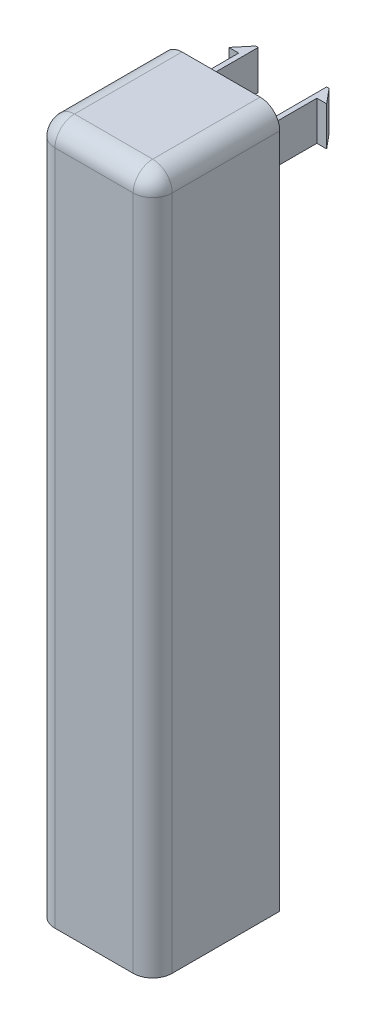
ISO-10303-21;
HEADER;
FILE_DESCRIPTION(('STEP AP214'),'2;1');
FILE_NAME('part.step','',(''),(''),'','','');
FILE_SCHEMA(('AUTOMOTIVE_DESIGN { 1 0 10303 214 1 1 1 1 }'));
ENDSEC;
DATA;
#1=APPLICATION_CONTEXT('core data for automotive mechanical design processes');
#2=APPLICATION_PROTOCOL_DEFINITION('international standard','automotive_design',2000,#1);
#3=PRODUCT_CONTEXT('',#1,'mechanical');
#4=PRODUCT('Part','Part','',(#3));
#5=PRODUCT_RELATED_PRODUCT_CATEGORY('part','',(#4));
#6=PRODUCT_DEFINITION_FORMATION('','',#4);
#7=PRODUCT_DEFINITION_CONTEXT('part definition',#1,'design');
#8=PRODUCT_DEFINITION('design','',#6,#7);
#9=PRODUCT_DEFINITION_SHAPE('','',#8);
#10=(LENGTH_UNIT() NAMED_UNIT(*) SI_UNIT(.MILLI.,.METRE.));
#11=(NAMED_UNIT(*) PLANE_ANGLE_UNIT() SI_UNIT($,.RADIAN.));
#12=(NAMED_UNIT(*) SI_UNIT($,.STERADIAN.) SOLID_ANGLE_UNIT());
#13=UNCERTAINTY_MEASURE_WITH_UNIT(LENGTH_MEASURE(1.E-05),#10,'distance_accuracy_value','');
#14=(GEOMETRIC_REPRESENTATION_CONTEXT(3) GLOBAL_UNCERTAINTY_ASSIGNED_CONTEXT((#13)) GLOBAL_UNIT_ASSIGNED_CONTEXT((#10,
#11,#12)) REPRESENTATION_CONTEXT('',''));
#15=CARTESIAN_POINT('',(0.,0.,0.));
#16=DIRECTION('',(0.,0.,1.));
#17=DIRECTION('',(1.,0.,0.));
#18=AXIS2_PLACEMENT_3D('',#15,#16,#17);
#19=CARTESIAN_POINT('',(0.,0.,0.));
#20=DIRECTION('',(0.,0.,1.));
#21=DIRECTION('',(1.,0.,0.));
#22=AXIS2_PLACEMENT_3D('',#19,#20,#21);
#23=PLANE('',#22);
#24=DIRECTION('',(0.,-1.,0.));
#25=VECTOR('',#24,1.);
#26=CARTESIAN_POINT('',(34.8,24.3,0.));
#27=LINE('',#26,#25);
#28=CARTESIAN_POINT('',(34.8,24.3,0.));
#29=VERTEX_POINT('',#28);
#30=CARTESIAN_POINT('',(34.8,20.3,0.));
#31=VERTEX_POINT('',#30);
#32=EDGE_CURVE('E277',#29,#31,#27,.T.);
#33=ORIENTED_EDGE('',*,*,#32,.F.);
#34=DIRECTION('',(0.,-1.,0.));
#35=VECTOR('',#34,1.);
#36=CARTESIAN_POINT('',(34.8,0.,0.));
#37=LINE('',#36,#35);
#38=CARTESIAN_POINT('',(34.8,25.3,0.));
#39=VERTEX_POINT('',#38);
#40=EDGE_CURVE('E346',#39,#29,#37,.T.);
#41=ORIENTED_EDGE('',*,*,#40,.F.);
#42=DIRECTION('',(-1.,0.,0.));
#43=VECTOR('',#42,1.);
#44=CARTESIAN_POINT('',(24.8,25.3,0.));
#45=LINE('',#44,#43);
#46=CARTESIAN_POINT('',(26.8,25.3,0.));
#47=VERTEX_POINT('',#46);
#48=EDGE_CURVE('E332',#39,#47,#45,.T.);
#49=ORIENTED_EDGE('',*,*,#48,.T.);
#50=DIRECTION('',(0.,-1.,0.));
#51=VECTOR('',#50,1.);
#52=CARTESIAN_POINT('',(26.8,0.,0.));
#53=LINE('',#52,#51);
#54=CARTESIAN_POINT('',(26.8,24.3,0.));
#55=VERTEX_POINT('',#54);
#56=EDGE_CURVE('E369',#47,#55,#53,.T.);
#57=ORIENTED_EDGE('',*,*,#56,.T.);
#58=DIRECTION('',(0.,1.,0.));
#59=VECTOR('',#58,1.);
#60=CARTESIAN_POINT('',(26.8,24.3,0.));
#61=LINE('',#60,#59);
#62=CARTESIAN_POINT('',(26.7999999999995,20.3000000000004,0.));
#63=VERTEX_POINT('',#62);
#64=EDGE_CURVE('E297',#63,#55,#61,.T.);
#65=ORIENTED_EDGE('',*,*,#64,.F.);
#66=CARTESIAN_POINT('',(26.8,-43.85,0.));
#67=VERTEX_POINT('',#66);
#68=EDGE_CURVE('E363',#63,#67,#53,.T.);
#69=ORIENTED_EDGE('',*,*,#68,.T.);
#70=DIRECTION('',(1.,0.,0.));
#71=VECTOR('',#70,1.);
#72=CARTESIAN_POINT('',(0.,-43.85,0.));
#73=LINE('',#72,#71);
#74=CARTESIAN_POINT('',(24.8,-43.85,0.));
#75=VERTEX_POINT('',#74);
#76=EDGE_CURVE('E368',#75,#67,#73,.T.);
#77=ORIENTED_EDGE('',*,*,#76,.F.);
#78=DIRECTION('',(0.,1.,0.));
#79=VECTOR('',#78,1.);
#80=CARTESIAN_POINT('',(24.8,0.,0.));
#81=LINE('',#80,#79);
#82=CARTESIAN_POINT('',(24.8,25.3,0.));
#83=VERTEX_POINT('',#82);
#84=EDGE_CURVE('E371',#75,#83,#81,.T.);
#85=ORIENTED_EDGE('',*,*,#84,.T.);
#86=CARTESIAN_POINT('',(26.8,25.3,0.));
#87=DIRECTION('',(0.,0.,1.));
#88=DIRECTION('',(1.,0.,0.));
#89=AXIS2_PLACEMENT_3D('',#86,#87,#88);
#90=CIRCLE('',#89,2.);
#91=CARTESIAN_POINT('',(26.8,27.3,0.));
#92=VERTEX_POINT('',#91);
#93=EDGE_CURVE('E400',#83,#92,#90,.F.);
#94=ORIENTED_EDGE('',*,*,#93,.T.);
#95=DIRECTION('',(1.,0.,0.));
#96=VECTOR('',#95,1.);
#97=CARTESIAN_POINT('',(0.,27.3,0.));
#98=LINE('',#97,#96);
#99=CARTESIAN_POINT('',(34.8,27.3,0.));
#100=VERTEX_POINT('',#99);
#101=EDGE_CURVE('E380',#92,#100,#98,.T.);
#102=ORIENTED_EDGE('',*,*,#101,.T.);
#103=CARTESIAN_POINT('',(34.8,25.3,0.));
#104=DIRECTION('',(0.,0.,1.));
#105=DIRECTION('',(1.,0.,0.));
#106=AXIS2_PLACEMENT_3D('',#103,#104,#105);
#107=CIRCLE('',#106,2.);
#108=CARTESIAN_POINT('',(36.8,25.3,0.));
#109=VERTEX_POINT('',#108);
#110=EDGE_CURVE('E402',#100,#109,#107,.F.);
#111=ORIENTED_EDGE('',*,*,#110,.T.);
#112=DIRECTION('',(0.,-1.,0.));
#113=VECTOR('',#112,1.);
#114=CARTESIAN_POINT('',(36.8,0.,0.));
#115=LINE('',#114,#113);
#116=CARTESIAN_POINT('',(36.8,-43.85,0.));
#117=VERTEX_POINT('',#116);
#118=EDGE_CURVE('E345',#109,#117,#115,.T.);
#119=ORIENTED_EDGE('',*,*,#118,.T.);
#120=DIRECTION('',(1.,0.,0.));
#121=VECTOR('',#120,1.);
#122=CARTESIAN_POINT('',(0.,-43.85,0.));
#123=LINE('',#122,#121);
#124=CARTESIAN_POINT('',(34.8,-43.85,0.));
#125=VERTEX_POINT('',#124);
#126=EDGE_CURVE('E348',#125,#117,#123,.T.);
#127=ORIENTED_EDGE('',*,*,#126,.F.);
#128=EDGE_CURVE('E341',#31,#125,#37,.T.);
#129=ORIENTED_EDGE('',*,*,#128,.F.);
#130=EDGE_LOOP('',(#33,#41,#49,#57,#65,#69,#77,#85,#94,#102,#111,#119,#127,#129));
#131=FACE_BOUND('',#130,.T.);
#132=ADVANCED_FACE('F39',(#131),#23,.F.);
#133=CARTESIAN_POINT('',(0.,0.,11.));
#134=DIRECTION('',(0.,0.,1.));
#135=DIRECTION('',(1.,0.,0.));
#136=AXIS2_PLACEMENT_3D('',#133,#134,#135);
#137=PLANE('',#136);
#138=DIRECTION('',(0.,-1.,0.));
#139=VECTOR('',#138,1.);
#140=CARTESIAN_POINT('',(26.8,0.,11.));
#141=LINE('',#140,#139);
#142=CARTESIAN_POINT('',(26.8,25.3,11.));
#143=VERTEX_POINT('',#142);
#144=CARTESIAN_POINT('',(26.8,-43.85,11.));
#145=VERTEX_POINT('',#144);
#146=EDGE_CURVE('E364',#143,#145,#141,.T.);
#147=ORIENTED_EDGE('',*,*,#146,.F.);
#148=DIRECTION('',(-1.,0.,0.));
#149=VECTOR('',#148,1.);
#150=CARTESIAN_POINT('',(26.8,25.3,11.));
#151=LINE('',#150,#149);
#152=CARTESIAN_POINT('',(34.8,25.3,11.));
#153=VERTEX_POINT('',#152);
#154=EDGE_CURVE('E329',#153,#143,#151,.T.);
#155=ORIENTED_EDGE('',*,*,#154,.F.);
#156=DIRECTION('',(0.,-1.,0.));
#157=VECTOR('',#156,1.);
#158=CARTESIAN_POINT('',(34.8,0.,11.));
#159=LINE('',#158,#157);
#160=CARTESIAN_POINT('',(34.8,-43.85,11.));
#161=VERTEX_POINT('',#160);
#162=EDGE_CURVE('E342',#153,#161,#159,.T.);
#163=ORIENTED_EDGE('',*,*,#162,.T.);
#164=DIRECTION('',(1.,0.,0.));
#165=VECTOR('',#164,1.);
#166=CARTESIAN_POINT('',(24.8,-43.85,11.));
#167=LINE('',#166,#165);
#168=EDGE_CURVE('E354',#145,#161,#167,.T.);
#169=ORIENTED_EDGE('',*,*,#168,.F.);
#170=EDGE_LOOP('',(#147,#155,#163,#169));
#171=FACE_BOUND('',#170,.T.);
#172=ADVANCED_FACE('F502',(#171),#137,.F.);
#173=CARTESIAN_POINT('',(34.8,0.,11.));
#174=DIRECTION('',(1.,0.,0.));
#175=DIRECTION('',(0.,0.,-1.));
#176=AXIS2_PLACEMENT_3D('',#173,#174,#175);
#177=PLANE('',#176);
#178=DIRECTION('',(0.,-1.,0.));
#179=VECTOR('',#178,1.);
#180=CARTESIAN_POINT('',(34.8,26.4213203435602,1.00000000000045));
#181=LINE('',#180,#179);
#182=CARTESIAN_POINT('',(34.8,24.3,1.00000000000045));
#183=VERTEX_POINT('',#182);
#184=CARTESIAN_POINT('',(34.8,20.3000000000005,1.00000000000042));
#185=VERTEX_POINT('',#184);
#186=EDGE_CURVE('E56',#183,#185,#181,.T.);
#187=ORIENTED_EDGE('',*,*,#186,.T.);
#188=DIRECTION('',(0.,0.,1.));
#189=VECTOR('',#188,1.);
#190=CARTESIAN_POINT('',(34.8,20.3000000000005,1.00000000000045));
#191=LINE('',#190,#189);
#192=EDGE_CURVE('E287',#31,#185,#191,.T.);
#193=ORIENTED_EDGE('',*,*,#192,.F.);
#194=ORIENTED_EDGE('',*,*,#128,.T.);
#195=DIRECTION('',(0.,0.,-1.));
#196=VECTOR('',#195,1.);
#197=CARTESIAN_POINT('',(34.8,-43.85,11.));
#198=LINE('',#197,#196);
#199=EDGE_CURVE('E344',#161,#125,#198,.T.);
#200=ORIENTED_EDGE('',*,*,#199,.F.);
#201=ORIENTED_EDGE('',*,*,#162,.F.);
#202=DIRECTION('',(0.,0.,1.));
#203=VECTOR('',#202,1.);
#204=CARTESIAN_POINT('',(34.8,25.3,11.));
#205=LINE('',#204,#203);
#206=EDGE_CURVE('E335',#39,#153,#205,.T.);
#207=ORIENTED_EDGE('',*,*,#206,.F.);
#208=ORIENTED_EDGE('',*,*,#40,.T.);
#209=DIRECTION('',(0.,0.,-1.));
#210=VECTOR('',#209,1.);
#211=CARTESIAN_POINT('',(34.8,24.3,1.00000000000045));
#212=LINE('',#211,#210);
#213=EDGE_CURVE('E61',#183,#29,#212,.T.);
#214=ORIENTED_EDGE('',*,*,#213,.F.);
#215=EDGE_LOOP('',(#187,#193,#194,#200,#201,#207,#208,#214));
#216=FACE_BOUND('',#215,.T.);
#217=ADVANCED_FACE('F479',(#216),#177,.F.);
#218=CARTESIAN_POINT('',(0.,0.,13.));
#219=DIRECTION('',(0.,0.,1.));
#220=DIRECTION('',(1.,0.,0.));
#221=AXIS2_PLACEMENT_3D('',#218,#219,#220);
#222=PLANE('',#221);
#223=DIRECTION('',(1.,0.,0.));
#224=VECTOR('',#223,1.);
#225=CARTESIAN_POINT('',(24.8,-43.85,13.));
#226=LINE('',#225,#224);
#227=CARTESIAN_POINT('',(26.8,-43.85,13.));
#228=VERTEX_POINT('',#227);
#229=CARTESIAN_POINT('',(34.8,-43.85,13.));
#230=VERTEX_POINT('',#229);
#231=EDGE_CURVE('E355',#228,#230,#226,.T.);
#232=ORIENTED_EDGE('',*,*,#231,.T.);
#233=DIRECTION('',(0.,1.,0.));
#234=VECTOR('',#233,1.);
#235=CARTESIAN_POINT('',(34.8,27.3,13.));
#236=LINE('',#235,#234);
#237=CARTESIAN_POINT('',(34.8,25.3,13.));
#238=VERTEX_POINT('',#237);
#239=EDGE_CURVE('E394',#230,#238,#236,.T.);
#240=ORIENTED_EDGE('',*,*,#239,.T.);
#241=DIRECTION('',(1.,0.,0.));
#242=VECTOR('',#241,1.);
#243=CARTESIAN_POINT('',(24.8,25.3,13.));
#244=LINE('',#243,#242);
#245=CARTESIAN_POINT('',(26.8,25.3,13.));
#246=VERTEX_POINT('',#245);
#247=EDGE_CURVE('E392',#238,#246,#244,.F.);
#248=ORIENTED_EDGE('',*,*,#247,.T.);
#249=DIRECTION('',(0.,-1.,0.));
#250=VECTOR('',#249,1.);
#251=CARTESIAN_POINT('',(26.8,0.,13.));
#252=LINE('',#251,#250);
#253=EDGE_CURVE('E390',#246,#228,#252,.T.);
#254=ORIENTED_EDGE('',*,*,#253,.T.);
#255=EDGE_LOOP('',(#232,#240,#248,#254));
#256=FACE_BOUND('',#255,.T.);
#257=ADVANCED_FACE('F458',(#256),#222,.T.);
#258=CARTESIAN_POINT('',(26.8,0.,11.));
#259=DIRECTION('',(1.,0.,0.));
#260=DIRECTION('',(0.,1.,0.));
#261=AXIS2_PLACEMENT_3D('',#258,#259,#260);
#262=PLANE('',#261);
#263=DIRECTION('',(0.,0.,-1.));
#264=VECTOR('',#263,1.);
#265=CARTESIAN_POINT('',(26.7999999999995,20.3000000000004,0.));
#266=LINE('',#265,#264);
#267=CARTESIAN_POINT('',(26.7999999999995,20.3000000000004,1.00000000000045));
#268=VERTEX_POINT('',#267);
#269=EDGE_CURVE('E321',#268,#63,#266,.T.);
#270=ORIENTED_EDGE('',*,*,#269,.F.);
#271=DIRECTION('',(0.,-1.,0.));
#272=VECTOR('',#271,1.);
#273=CARTESIAN_POINT('',(26.7999999999995,26.4213203435601,1.00000000000045));
#274=LINE('',#273,#272);
#275=CARTESIAN_POINT('',(26.7999999999995,24.3,1.00000000000045));
#276=VERTEX_POINT('',#275);
#277=EDGE_CURVE('E313',#276,#268,#274,.T.);
#278=ORIENTED_EDGE('',*,*,#277,.F.);
#279=DIRECTION('',(0.,0.,1.));
#280=VECTOR('',#279,1.);
#281=CARTESIAN_POINT('',(26.7999999999995,24.3,0.));
#282=LINE('',#281,#280);
#283=EDGE_CURVE('E310',#55,#276,#282,.T.);
#284=ORIENTED_EDGE('',*,*,#283,.F.);
#285=ORIENTED_EDGE('',*,*,#56,.F.);
#286=DIRECTION('',(0.,0.,1.));
#287=VECTOR('',#286,1.);
#288=CARTESIAN_POINT('',(26.8,25.3,11.));
#289=LINE('',#288,#287);
#290=EDGE_CURVE('E338',#47,#143,#289,.T.);
#291=ORIENTED_EDGE('',*,*,#290,.T.);
#292=ORIENTED_EDGE('',*,*,#146,.T.);
#293=DIRECTION('',(0.,0.,-1.));
#294=VECTOR('',#293,1.);
#295=CARTESIAN_POINT('',(26.8,-43.85,11.));
#296=LINE('',#295,#294);
#297=EDGE_CURVE('E367',#145,#67,#296,.T.);
#298=ORIENTED_EDGE('',*,*,#297,.T.);
#299=ORIENTED_EDGE('',*,*,#68,.F.);
#300=EDGE_LOOP('',(#270,#278,#284,#285,#291,#292,#298,#299));
#301=FACE_BOUND('',#300,.T.);
#302=ADVANCED_FACE('F546',(#301),#262,.T.);
#303=CARTESIAN_POINT('',(24.8,0.,11.));
#304=DIRECTION('',(-1.,0.,0.));
#305=DIRECTION('',(0.,0.,1.));
#306=AXIS2_PLACEMENT_3D('',#303,#304,#305);
#307=PLANE('',#306);
#308=DIRECTION('',(0.,-1.,0.));
#309=VECTOR('',#308,1.);
#310=CARTESIAN_POINT('',(24.8,0.,11.));
#311=LINE('',#310,#309);
#312=CARTESIAN_POINT('',(24.8,-43.85,11.));
#313=VERTEX_POINT('',#312);
#314=CARTESIAN_POINT('',(24.8,25.3,11.));
#315=VERTEX_POINT('',#314);
#316=EDGE_CURVE('E48',#313,#315,#311,.F.);
#317=ORIENTED_EDGE('',*,*,#316,.T.);
#318=DIRECTION('',(0.,0.,1.));
#319=VECTOR('',#318,1.);
#320=CARTESIAN_POINT('',(24.8,25.3,0.));
#321=LINE('',#320,#319);
#322=EDGE_CURVE('E11',#315,#83,#321,.F.);
#323=ORIENTED_EDGE('',*,*,#322,.T.);
#324=ORIENTED_EDGE('',*,*,#84,.F.);
#325=DIRECTION('',(0.,0.,-1.));
#326=VECTOR('',#325,1.);
#327=CARTESIAN_POINT('',(24.8,-43.85,11.));
#328=LINE('',#327,#326);
#329=EDGE_CURVE('E378',#313,#75,#328,.T.);
#330=ORIENTED_EDGE('',*,*,#329,.F.);
#331=EDGE_LOOP('',(#317,#323,#324,#330));
#332=FACE_BOUND('',#331,.T.);
#333=ADVANCED_FACE('F445',(#332),#307,.T.);
#334=CARTESIAN_POINT('',(0.,-43.85,11.));
#335=DIRECTION('',(0.,1.,0.));
#336=DIRECTION('',(0.,0.,1.));
#337=AXIS2_PLACEMENT_3D('',#334,#335,#336);
#338=PLANE('',#337);
#339=DIRECTION('',(0.,0.,-1.));
#340=VECTOR('',#339,1.);
#341=CARTESIAN_POINT('',(36.8,-43.85,13.));
#342=LINE('',#341,#340);
#343=CARTESIAN_POINT('',(36.8,-43.85,11.));
#344=VERTEX_POINT('',#343);
#345=EDGE_CURVE('E358',#344,#117,#342,.T.);
#346=ORIENTED_EDGE('',*,*,#345,.F.);
#347=CARTESIAN_POINT('',(34.8,-43.85,11.));
#348=DIRECTION('',(0.,1.,0.));
#349=DIRECTION('',(0.,0.,1.));
#350=AXIS2_PLACEMENT_3D('',#347,#348,#349);
#351=CIRCLE('',#350,2.);
#352=EDGE_CURVE('E406',#344,#230,#351,.F.);
#353=ORIENTED_EDGE('',*,*,#352,.T.);
#354=ORIENTED_EDGE('',*,*,#231,.F.);
#355=CARTESIAN_POINT('',(26.8,-43.85,11.));
#356=DIRECTION('',(0.,1.,0.));
#357=DIRECTION('',(0.,0.,1.));
#358=AXIS2_PLACEMENT_3D('',#355,#356,#357);
#359=CIRCLE('',#358,2.);
#360=EDGE_CURVE('E404',#228,#313,#359,.F.);
#361=ORIENTED_EDGE('',*,*,#360,.T.);
#362=ORIENTED_EDGE('',*,*,#329,.T.);
#363=ORIENTED_EDGE('',*,*,#76,.T.);
#364=ORIENTED_EDGE('',*,*,#297,.F.);
#365=ORIENTED_EDGE('',*,*,#168,.T.);
#366=ORIENTED_EDGE('',*,*,#199,.T.);
#367=ORIENTED_EDGE('',*,*,#126,.T.);
#368=EDGE_LOOP('',(#346,#353,#354,#361,#362,#363,#364,#365,#366,#367));
#369=FACE_BOUND('',#368,.T.);
#370=ADVANCED_FACE('F454',(#369),#338,.F.);
#371=CARTESIAN_POINT('',(36.8,-43.85,13.));
#372=DIRECTION('',(-1.,0.,0.));
#373=DIRECTION('',(0.,0.,1.));
#374=AXIS2_PLACEMENT_3D('',#371,#372,#373);
#375=PLANE('',#374);
#376=ORIENTED_EDGE('',*,*,#118,.F.);
#377=DIRECTION('',(0.,0.,1.));
#378=VECTOR('',#377,1.);
#379=CARTESIAN_POINT('',(36.8,25.3,13.));
#380=LINE('',#379,#378);
#381=CARTESIAN_POINT('',(36.8,25.3,11.));
#382=VERTEX_POINT('',#381);
#383=EDGE_CURVE('E398',#109,#382,#380,.T.);
#384=ORIENTED_EDGE('',*,*,#383,.T.);
#385=DIRECTION('',(0.,1.,0.));
#386=VECTOR('',#385,1.);
#387=CARTESIAN_POINT('',(36.8,-43.85,11.));
#388=LINE('',#387,#386);
#389=EDGE_CURVE('E396',#382,#344,#388,.F.);
#390=ORIENTED_EDGE('',*,*,#389,.T.);
#391=ORIENTED_EDGE('',*,*,#345,.T.);
#392=EDGE_LOOP('',(#376,#384,#390,#391));
#393=FACE_BOUND('',#392,.T.);
#394=ADVANCED_FACE('F475',(#393),#375,.F.);
#395=CARTESIAN_POINT('',(24.8,27.3,0.));
#396=DIRECTION('',(0.,-1.,0.));
#397=DIRECTION('',(0.,0.,-1.));
#398=AXIS2_PLACEMENT_3D('',#395,#396,#397);
#399=PLANE('',#398);
#400=DIRECTION('',(1.,0.,0.));
#401=VECTOR('',#400,1.);
#402=CARTESIAN_POINT('',(36.8,27.3,11.));
#403=LINE('',#402,#401);
#404=CARTESIAN_POINT('',(26.8,27.3,11.));
#405=VERTEX_POINT('',#404);
#406=CARTESIAN_POINT('',(34.8,27.3,11.));
#407=VERTEX_POINT('',#406);
#408=EDGE_CURVE('E385',#405,#407,#403,.T.);
#409=ORIENTED_EDGE('',*,*,#408,.T.);
#410=DIRECTION('',(0.,0.,1.));
#411=VECTOR('',#410,1.);
#412=CARTESIAN_POINT('',(34.8,27.3,0.));
#413=LINE('',#412,#411);
#414=EDGE_CURVE('E388',#407,#100,#413,.F.);
#415=ORIENTED_EDGE('',*,*,#414,.T.);
#416=ORIENTED_EDGE('',*,*,#101,.F.);
#417=DIRECTION('',(0.,0.,1.));
#418=VECTOR('',#417,1.);
#419=CARTESIAN_POINT('',(26.8,27.3,13.));
#420=LINE('',#419,#418);
#421=EDGE_CURVE('E383',#92,#405,#420,.T.);
#422=ORIENTED_EDGE('',*,*,#421,.T.);
#423=EDGE_LOOP('',(#409,#415,#416,#422));
#424=FACE_BOUND('',#423,.T.);
#425=ADVANCED_FACE('F435',(#424),#399,.F.);
#426=CARTESIAN_POINT('',(0.,25.3,0.));
#427=DIRECTION('',(0.,1.,0.));
#428=DIRECTION('',(0.,0.,1.));
#429=AXIS2_PLACEMENT_3D('',#426,#427,#428);
#430=PLANE('',#429);
#431=ORIENTED_EDGE('',*,*,#206,.T.);
#432=ORIENTED_EDGE('',*,*,#154,.T.);
#433=ORIENTED_EDGE('',*,*,#290,.F.);
#434=ORIENTED_EDGE('',*,*,#48,.F.);
#435=EDGE_LOOP('',(#431,#432,#433,#434));
#436=FACE_BOUND('',#435,.T.);
#437=ADVANCED_FACE('F525',(#436),#430,.F.);
#438=CARTESIAN_POINT('',(26.8,0.,11.));
#439=DIRECTION('',(0.,-1.,0.));
#440=DIRECTION('',(0.,0.,-1.));
#441=AXIS2_PLACEMENT_3D('',#438,#439,#440);
#442=CYLINDRICAL_SURFACE('',#441,2.);
#443=ORIENTED_EDGE('',*,*,#360,.F.);
#444=ORIENTED_EDGE('',*,*,#253,.F.);
#445=CARTESIAN_POINT('',(26.8,25.3,11.));
#446=DIRECTION('',(0.,1.,0.));
#447=DIRECTION('',(0.,0.,1.));
#448=AXIS2_PLACEMENT_3D('',#445,#446,#447);
#449=CIRCLE('',#448,2.);
#450=EDGE_CURVE('E43',#315,#246,#449,.T.);
#451=ORIENTED_EDGE('',*,*,#450,.F.);
#452=ORIENTED_EDGE('',*,*,#316,.F.);
#453=EDGE_LOOP('',(#443,#444,#451,#452));
#454=FACE_BOUND('',#453,.T.);
#455=ADVANCED_FACE('F41',(#454),#442,.T.);
#456=CARTESIAN_POINT('',(26.8,25.3,0.));
#457=DIRECTION('',(0.,0.,-1.));
#458=DIRECTION('',(-1.,0.,0.));
#459=AXIS2_PLACEMENT_3D('',#456,#457,#458);
#460=CYLINDRICAL_SURFACE('',#459,2.);
#461=ORIENTED_EDGE('',*,*,#93,.F.);
#462=ORIENTED_EDGE('',*,*,#322,.F.);
#463=CARTESIAN_POINT('',(26.8,25.3,11.));
#464=DIRECTION('',(0.,0.,1.));
#465=DIRECTION('',(1.,0.,0.));
#466=AXIS2_PLACEMENT_3D('',#463,#464,#465);
#467=CIRCLE('',#466,2.);
#468=EDGE_CURVE('E418',#405,#315,#467,.T.);
#469=ORIENTED_EDGE('',*,*,#468,.F.);
#470=ORIENTED_EDGE('',*,*,#421,.F.);
#471=EDGE_LOOP('',(#461,#462,#469,#470));
#472=FACE_BOUND('',#471,.T.);
#473=ADVANCED_FACE('F442',(#472),#460,.T.);
#474=CARTESIAN_POINT('',(34.8,25.3,13.));
#475=DIRECTION('',(0.,0.,1.));
#476=DIRECTION('',(1.,0.,0.));
#477=AXIS2_PLACEMENT_3D('',#474,#475,#476);
#478=CYLINDRICAL_SURFACE('',#477,2.);
#479=ORIENTED_EDGE('',*,*,#110,.F.);
#480=ORIENTED_EDGE('',*,*,#414,.F.);
#481=CARTESIAN_POINT('',(34.8,25.3,11.));
#482=DIRECTION('',(0.,0.,1.));
#483=DIRECTION('',(1.,0.,0.));
#484=AXIS2_PLACEMENT_3D('',#481,#482,#483);
#485=CIRCLE('',#484,2.);
#486=EDGE_CURVE('E416',#382,#407,#485,.T.);
#487=ORIENTED_EDGE('',*,*,#486,.F.);
#488=ORIENTED_EDGE('',*,*,#383,.F.);
#489=EDGE_LOOP('',(#479,#480,#487,#488));
#490=FACE_BOUND('',#489,.T.);
#491=ADVANCED_FACE('F471',(#490),#478,.T.);
#492=CARTESIAN_POINT('',(34.8,0.,11.));
#493=DIRECTION('',(0.,-1.,0.));
#494=DIRECTION('',(0.,0.,-1.));
#495=AXIS2_PLACEMENT_3D('',#492,#493,#494);
#496=CYLINDRICAL_SURFACE('',#495,2.);
#497=ORIENTED_EDGE('',*,*,#352,.F.);
#498=ORIENTED_EDGE('',*,*,#389,.F.);
#499=CARTESIAN_POINT('',(34.8,25.3,11.));
#500=DIRECTION('',(0.,1.,0.));
#501=DIRECTION('',(-1.,0.,0.));
#502=AXIS2_PLACEMENT_3D('',#499,#500,#501);
#503=CIRCLE('',#502,2.);
#504=EDGE_CURVE('E413',#238,#382,#503,.T.);
#505=ORIENTED_EDGE('',*,*,#504,.F.);
#506=ORIENTED_EDGE('',*,*,#239,.F.);
#507=EDGE_LOOP('',(#497,#498,#505,#506));
#508=FACE_BOUND('',#507,.T.);
#509=ADVANCED_FACE('F463',(#508),#496,.T.);
#510=CARTESIAN_POINT('',(26.8,25.3,11.));
#511=DIRECTION('',(-1.,0.,0.));
#512=DIRECTION('',(0.,0.,1.));
#513=AXIS2_PLACEMENT_3D('',#510,#511,#512);
#514=SPHERICAL_SURFACE('',#513,2.);
#515=ORIENTED_EDGE('',*,*,#468,.T.);
#516=ORIENTED_EDGE('',*,*,#450,.T.);
#517=CARTESIAN_POINT('',(26.8,25.3,11.));
#518=DIRECTION('',(-1.,0.,0.));
#519=DIRECTION('',(0.,0.,1.));
#520=AXIS2_PLACEMENT_3D('',#517,#518,#519);
#521=CIRCLE('',#520,2.);
#522=EDGE_CURVE('E410',#405,#246,#521,.F.);
#523=ORIENTED_EDGE('',*,*,#522,.F.);
#524=EDGE_LOOP('',(#515,#516,#523));
#525=FACE_BOUND('',#524,.T.);
#526=ADVANCED_FACE('F425',(#525),#514,.T.);
#527=CARTESIAN_POINT('',(34.8,25.3,11.));
#528=DIRECTION('',(1.,0.,0.));
#529=DIRECTION('',(0.,1.,0.));
#530=AXIS2_PLACEMENT_3D('',#527,#528,#529);
#531=SPHERICAL_SURFACE('',#530,2.);
#532=ORIENTED_EDGE('',*,*,#504,.T.);
#533=ORIENTED_EDGE('',*,*,#486,.T.);
#534=CARTESIAN_POINT('',(34.8,25.3,11.));
#535=DIRECTION('',(1.,0.,0.));
#536=DIRECTION('',(0.,0.,-1.));
#537=AXIS2_PLACEMENT_3D('',#534,#535,#536);
#538=CIRCLE('',#537,2.);
#539=EDGE_CURVE('E328',#238,#407,#538,.F.);
#540=ORIENTED_EDGE('',*,*,#539,.F.);
#541=EDGE_LOOP('',(#532,#533,#540));
#542=FACE_BOUND('',#541,.T.);
#543=ADVANCED_FACE('F467',(#542),#531,.T.);
#544=CARTESIAN_POINT('',(24.8,25.3,11.));
#545=DIRECTION('',(-1.,0.,0.));
#546=DIRECTION('',(0.,0.,1.));
#547=AXIS2_PLACEMENT_3D('',#544,#545,#546);
#548=CYLINDRICAL_SURFACE('',#547,2.);
#549=ORIENTED_EDGE('',*,*,#522,.T.);
#550=ORIENTED_EDGE('',*,*,#247,.F.);
#551=ORIENTED_EDGE('',*,*,#539,.T.);
#552=ORIENTED_EDGE('',*,*,#408,.F.);
#553=EDGE_LOOP('',(#549,#550,#551,#552));
#554=FACE_BOUND('',#553,.T.);
#555=ADVANCED_FACE('F432',(#554),#548,.T.);
#556=CARTESIAN_POINT('',(27.3000000000004,26.4213203435601,0.5));
#557=DIRECTION('',(1.,0.,-9.43689570931383E-13));
#558=DIRECTION('',(-9.43689570931383E-13,0.,-1.));
#559=AXIS2_PLACEMENT_3D('',#556,#557,#558);
#560=PLANE('',#559);
#561=DIRECTION('',(-9.43689570931383E-13,0.,-1.));
#562=VECTOR('',#561,1.);
#563=CARTESIAN_POINT('',(27.3000000000004,24.3,0.5));
#564=LINE('',#563,#562);
#565=CARTESIAN_POINT('',(27.3000000000004,24.3,0.5));
#566=VERTEX_POINT('',#565);
#567=CARTESIAN_POINT('',(27.3000000000004,24.3,-7.3));
#568=VERTEX_POINT('',#567);
#569=EDGE_CURVE('E312',#566,#568,#564,.T.);
#570=ORIENTED_EDGE('',*,*,#569,.F.);
#571=DIRECTION('',(0.,-1.,0.));
#572=VECTOR('',#571,1.);
#573=CARTESIAN_POINT('',(27.3000000000004,26.4213203435601,0.5));
#574=LINE('',#573,#572);
#575=CARTESIAN_POINT('',(27.3000000000005,20.3000000000004,0.5));
#576=VERTEX_POINT('',#575);
#577=EDGE_CURVE('E324',#566,#576,#574,.T.);
#578=ORIENTED_EDGE('',*,*,#577,.T.);
#579=DIRECTION('',(9.43689570931383E-13,0.,1.));
#580=VECTOR('',#579,1.);
#581=CARTESIAN_POINT('',(27.3000000000005,20.3000000000004,0.5));
#582=LINE('',#581,#580);
#583=CARTESIAN_POINT('',(27.3000000000004,20.3000000000004,-7.3));
#584=VERTEX_POINT('',#583);
#585=EDGE_CURVE('E309',#584,#576,#582,.T.);
#586=ORIENTED_EDGE('',*,*,#585,.F.);
#587=DIRECTION('',(0.,-1.,0.));
#588=VECTOR('',#587,1.);
#589=CARTESIAN_POINT('',(27.3000000000004,26.4213203435601,-7.3));
#590=LINE('',#589,#588);
#591=EDGE_CURVE('E258',#568,#584,#590,.T.);
#592=ORIENTED_EDGE('',*,*,#591,.F.);
#593=EDGE_LOOP('',(#570,#578,#586,#592));
#594=FACE_BOUND('',#593,.T.);
#595=ADVANCED_FACE('F513',(#594),#560,.T.);
#596=CARTESIAN_POINT('',(27.3000000000004,26.4213203435601,0.5));
#597=DIRECTION('',(0.707106781186214,0.,0.707106781186881));
#598=DIRECTION('',(0.707106781186881,0.,-0.707106781186214));
#599=AXIS2_PLACEMENT_3D('',#596,#597,#598);
#600=PLANE('',#599);
#601=DIRECTION('',(0.707106781186881,0.,-0.707106781186214));
#602=VECTOR('',#601,1.);
#603=CARTESIAN_POINT('',(27.3000000000004,24.3,0.500000000000007));
#604=LINE('',#603,#602);
#605=EDGE_CURVE('E315',#276,#566,#604,.T.);
#606=ORIENTED_EDGE('',*,*,#605,.F.);
#607=ORIENTED_EDGE('',*,*,#277,.T.);
#608=DIRECTION('',(-0.707106781186881,0.,0.707106781186214));
#609=VECTOR('',#608,1.);
#610=CARTESIAN_POINT('',(27.3000000000005,20.3000000000004,0.5));
#611=LINE('',#610,#609);
#612=EDGE_CURVE('E318',#576,#268,#611,.T.);
#613=ORIENTED_EDGE('',*,*,#612,.F.);
#614=ORIENTED_EDGE('',*,*,#577,.F.);
#615=EDGE_LOOP('',(#606,#607,#613,#614));
#616=FACE_BOUND('',#615,.T.);
#617=ADVANCED_FACE('F720',(#616),#600,.T.);
#618=CARTESIAN_POINT('',(-1.40859546249192E-13,20.3000000000002,0.));
#619=DIRECTION('',(0.,-1.,0.));
#620=DIRECTION('',(1.,0.,0.));
#621=AXIS2_PLACEMENT_3D('',#618,#619,#620);
#622=PLANE('',#621);
#623=ORIENTED_EDGE('',*,*,#585,.T.);
#624=ORIENTED_EDGE('',*,*,#612,.T.);
#625=ORIENTED_EDGE('',*,*,#269,.T.);
#626=DIRECTION('',(0.,0.,1.));
#627=VECTOR('',#626,1.);
#628=CARTESIAN_POINT('',(26.8,20.3,-5.8));
#629=LINE('',#628,#627);
#630=CARTESIAN_POINT('',(26.8,20.3,-5.8));
#631=VERTEX_POINT('',#630);
#632=EDGE_CURVE('E306',#631,#63,#629,.T.);
#633=ORIENTED_EDGE('',*,*,#632,.F.);
#634=DIRECTION('',(-1.,0.,0.));
#635=VECTOR('',#634,1.);
#636=CARTESIAN_POINT('',(26.8000000000003,20.3000000000004,-5.8));
#637=LINE('',#636,#635);
#638=CARTESIAN_POINT('',(25.8000000000003,20.3000000000004,-5.8));
#639=VERTEX_POINT('',#638);
#640=EDGE_CURVE('E254',#631,#639,#637,.T.);
#641=ORIENTED_EDGE('',*,*,#640,.T.);
#642=DIRECTION('',(0.64018439966448,0.,-0.768221279597375));
#643=VECTOR('',#642,1.);
#644=CARTESIAN_POINT('',(25.8000000000003,20.3000000000004,-5.8));
#645=LINE('',#644,#643);
#646=CARTESIAN_POINT('',(27.0500000000003,20.3000000000004,-7.3));
#647=VERTEX_POINT('',#646);
#648=EDGE_CURVE('E262',#639,#647,#645,.T.);
#649=ORIENTED_EDGE('',*,*,#648,.T.);
#650=DIRECTION('',(1.,0.,0.));
#651=VECTOR('',#650,1.);
#652=CARTESIAN_POINT('',(27.0500000000003,20.3000000000004,-7.3));
#653=LINE('',#652,#651);
#654=EDGE_CURVE('E265',#647,#584,#653,.T.);
#655=ORIENTED_EDGE('',*,*,#654,.T.);
#656=EDGE_LOOP('',(#623,#624,#625,#633,#641,#649,#655));
#657=FACE_BOUND('',#656,.T.);
#658=ADVANCED_FACE('F735',(#657),#622,.T.);
#659=CARTESIAN_POINT('',(26.8,24.3,-5.8));
#660=DIRECTION('',(0.,-1.,0.));
#661=DIRECTION('',(0.,0.,-1.));
#662=AXIS2_PLACEMENT_3D('',#659,#660,#661);
#663=PLANE('',#662);
#664=ORIENTED_EDGE('',*,*,#569,.T.);
#665=DIRECTION('',(-1.,0.,0.));
#666=VECTOR('',#665,1.);
#667=CARTESIAN_POINT('',(27.0500000000002,24.3,-7.3));
#668=LINE('',#667,#666);
#669=CARTESIAN_POINT('',(27.0500000000002,24.3,-7.3));
#670=VERTEX_POINT('',#669);
#671=EDGE_CURVE('E257',#568,#670,#668,.T.);
#672=ORIENTED_EDGE('',*,*,#671,.T.);
#673=DIRECTION('',(-0.64018439966448,0.,0.768221279597375));
#674=VECTOR('',#673,1.);
#675=CARTESIAN_POINT('',(25.8000000000002,24.3,-5.79999999999999));
#676=LINE('',#675,#674);
#677=CARTESIAN_POINT('',(25.8000000000002,24.3,-5.8));
#678=VERTEX_POINT('',#677);
#679=EDGE_CURVE('E255',#670,#678,#676,.T.);
#680=ORIENTED_EDGE('',*,*,#679,.T.);
#681=DIRECTION('',(1.,0.,0.));
#682=VECTOR('',#681,1.);
#683=CARTESIAN_POINT('',(26.8000000000002,24.3,-5.8));
#684=LINE('',#683,#682);
#685=CARTESIAN_POINT('',(26.8,24.3,-5.8));
#686=VERTEX_POINT('',#685);
#687=EDGE_CURVE('E260',#678,#686,#684,.T.);
#688=ORIENTED_EDGE('',*,*,#687,.T.);
#689=DIRECTION('',(0.,0.,1.));
#690=VECTOR('',#689,1.);
#691=CARTESIAN_POINT('',(26.8,24.3,-5.8));
#692=LINE('',#691,#690);
#693=EDGE_CURVE('E301',#686,#55,#692,.T.);
#694=ORIENTED_EDGE('',*,*,#693,.T.);
#695=ORIENTED_EDGE('',*,*,#283,.T.);
#696=ORIENTED_EDGE('',*,*,#605,.T.);
#697=EDGE_LOOP('',(#664,#672,#680,#688,#694,#695,#696));
#698=FACE_BOUND('',#697,.T.);
#699=ADVANCED_FACE('F743',(#698),#663,.F.);
#700=CARTESIAN_POINT('',(26.8,24.3,-5.8));
#701=DIRECTION('',(1.,0.,0.));
#702=DIRECTION('',(0.,0.,-1.));
#703=AXIS2_PLACEMENT_3D('',#700,#701,#702);
#704=PLANE('',#703);
#705=ORIENTED_EDGE('',*,*,#64,.T.);
#706=ORIENTED_EDGE('',*,*,#693,.F.);
#707=DIRECTION('',(0.,1.,0.));
#708=VECTOR('',#707,1.);
#709=CARTESIAN_POINT('',(26.8,24.3,-5.8));
#710=LINE('',#709,#708);
#711=EDGE_CURVE('E298',#631,#686,#710,.T.);
#712=ORIENTED_EDGE('',*,*,#711,.F.);
#713=ORIENTED_EDGE('',*,*,#632,.T.);
#714=EDGE_LOOP('',(#705,#706,#712,#713));
#715=FACE_BOUND('',#714,.T.);
#716=ADVANCED_FACE('F498',(#715),#704,.F.);
#717=CARTESIAN_POINT('',(34.2999999999991,26.4213203435602,0.5));
#718=DIRECTION('',(-1.,0.,-9.43689570931383E-13));
#719=DIRECTION('',(-9.43689570931383E-13,0.,1.));
#720=AXIS2_PLACEMENT_3D('',#717,#718,#719);
#721=PLANE('',#720);
#722=DIRECTION('',(-9.43689570931383E-13,0.,1.));
#723=VECTOR('',#722,1.);
#724=CARTESIAN_POINT('',(34.2999999999991,24.3,0.5));
#725=LINE('',#724,#723);
#726=CARTESIAN_POINT('',(34.2999999999991,24.3,-7.3));
#727=VERTEX_POINT('',#726);
#728=CARTESIAN_POINT('',(34.2999999999991,24.3,0.5));
#729=VERTEX_POINT('',#728);
#730=EDGE_CURVE('E229',#727,#729,#725,.T.);
#731=ORIENTED_EDGE('',*,*,#730,.F.);
#732=DIRECTION('',(0.,-1.,0.));
#733=VECTOR('',#732,1.);
#734=CARTESIAN_POINT('',(34.2999999999991,26.4213203435602,-7.3));
#735=LINE('',#734,#733);
#736=CARTESIAN_POINT('',(34.2999999999991,20.3000000000005,-7.3));
#737=VERTEX_POINT('',#736);
#738=EDGE_CURVE('E227',#727,#737,#735,.T.);
#739=ORIENTED_EDGE('',*,*,#738,.T.);
#740=DIRECTION('',(9.43689570931383E-13,0.,-1.));
#741=VECTOR('',#740,1.);
#742=CARTESIAN_POINT('',(34.2999999999991,20.3000000000005,0.5));
#743=LINE('',#742,#741);
#744=CARTESIAN_POINT('',(34.2999999999991,20.3000000000005,0.5));
#745=VERTEX_POINT('',#744);
#746=EDGE_CURVE('E215',#745,#737,#743,.T.);
#747=ORIENTED_EDGE('',*,*,#746,.F.);
#748=DIRECTION('',(0.,-1.,0.));
#749=VECTOR('',#748,1.);
#750=CARTESIAN_POINT('',(34.2999999999991,26.4213203435602,0.5));
#751=LINE('',#750,#749);
#752=EDGE_CURVE('E290',#729,#745,#751,.T.);
#753=ORIENTED_EDGE('',*,*,#752,.F.);
#754=EDGE_LOOP('',(#731,#739,#747,#753));
#755=FACE_BOUND('',#754,.T.);
#756=ADVANCED_FACE('F228',(#755),#721,.T.);
#757=CARTESIAN_POINT('',(34.2999999999991,26.4213203435602,0.5));
#758=DIRECTION('',(-0.707106781186216,0.,0.707106781186879));
#759=DIRECTION('',(0.707106781186879,0.,0.707106781186216));
#760=AXIS2_PLACEMENT_3D('',#757,#758,#759);
#761=PLANE('',#760);
#762=DIRECTION('',(0.707106781186879,0.,0.707106781186216));
#763=VECTOR('',#762,1.);
#764=CARTESIAN_POINT('',(34.2999999999991,24.3,0.499999999999993));
#765=LINE('',#764,#763);
#766=EDGE_CURVE('E288',#729,#183,#765,.T.);
#767=ORIENTED_EDGE('',*,*,#766,.F.);
#768=ORIENTED_EDGE('',*,*,#752,.T.);
#769=DIRECTION('',(-0.707106781186879,0.,-0.707106781186216));
#770=VECTOR('',#769,1.);
#771=CARTESIAN_POINT('',(34.2999999999991,20.3000000000005,0.5));
#772=LINE('',#771,#770);
#773=EDGE_CURVE('E222',#185,#745,#772,.T.);
#774=ORIENTED_EDGE('',*,*,#773,.F.);
#775=ORIENTED_EDGE('',*,*,#186,.F.);
#776=EDGE_LOOP('',(#767,#768,#774,#775));
#777=FACE_BOUND('',#776,.T.);
#778=ADVANCED_FACE('F490',(#777),#761,.T.);
#779=CARTESIAN_POINT('',(-1.40859546249193E-13,20.3000000000002,0.));
#780=DIRECTION('',(0.,-1.,0.));
#781=DIRECTION('',(1.,0.,0.));
#782=AXIS2_PLACEMENT_3D('',#779,#780,#781);
#783=PLANE('',#782);
#784=ORIENTED_EDGE('',*,*,#746,.T.);
#785=DIRECTION('',(1.,0.,0.));
#786=VECTOR('',#785,1.);
#787=CARTESIAN_POINT('',(34.5499999999999,20.3000000000005,-7.3));
#788=LINE('',#787,#786);
#789=CARTESIAN_POINT('',(34.5499999999999,20.3000000000005,-7.3));
#790=VERTEX_POINT('',#789);
#791=EDGE_CURVE('E220',#737,#790,#788,.T.);
#792=ORIENTED_EDGE('',*,*,#791,.T.);
#793=DIRECTION('',(0.64018439966448,0.,0.768221279597375));
#794=VECTOR('',#793,1.);
#795=CARTESIAN_POINT('',(35.7999999999999,20.3000000000005,-5.8));
#796=LINE('',#795,#794);
#797=CARTESIAN_POINT('',(35.7999999999999,20.3000000000005,-5.8));
#798=VERTEX_POINT('',#797);
#799=EDGE_CURVE('E239',#790,#798,#796,.T.);
#800=ORIENTED_EDGE('',*,*,#799,.T.);
#801=DIRECTION('',(-1.,0.,0.));
#802=VECTOR('',#801,1.);
#803=CARTESIAN_POINT('',(34.2999999999999,20.3000000000005,-5.8));
#804=LINE('',#803,#802);
#805=CARTESIAN_POINT('',(34.8,20.3000000000005,-5.8));
#806=VERTEX_POINT('',#805);
#807=EDGE_CURVE('E234',#798,#806,#804,.T.);
#808=ORIENTED_EDGE('',*,*,#807,.T.);
#809=DIRECTION('',(0.,0.,1.));
#810=VECTOR('',#809,1.);
#811=CARTESIAN_POINT('',(34.8,20.3,-5.8));
#812=LINE('',#811,#810);
#813=EDGE_CURVE('E285',#806,#31,#812,.T.);
#814=ORIENTED_EDGE('',*,*,#813,.T.);
#815=ORIENTED_EDGE('',*,*,#192,.T.);
#816=ORIENTED_EDGE('',*,*,#773,.T.);
#817=EDGE_LOOP('',(#784,#792,#800,#808,#814,#815,#816));
#818=FACE_BOUND('',#817,.T.);
#819=ADVANCED_FACE('F217',(#818),#783,.T.);
#820=CARTESIAN_POINT('',(26.8,24.3,-5.8));
#821=DIRECTION('',(0.,-1.,0.));
#822=DIRECTION('',(0.,0.,-1.));
#823=AXIS2_PLACEMENT_3D('',#820,#821,#822);
#824=PLANE('',#823);
#825=ORIENTED_EDGE('',*,*,#213,.T.);
#826=DIRECTION('',(0.,0.,1.));
#827=VECTOR('',#826,1.);
#828=CARTESIAN_POINT('',(34.8,24.3,-5.8));
#829=LINE('',#828,#827);
#830=CARTESIAN_POINT('',(34.8,24.3,-5.8));
#831=VERTEX_POINT('',#830);
#832=EDGE_CURVE('E281',#831,#29,#829,.T.);
#833=ORIENTED_EDGE('',*,*,#832,.F.);
#834=DIRECTION('',(1.,0.,0.));
#835=VECTOR('',#834,1.);
#836=CARTESIAN_POINT('',(34.2999999999998,24.3,-5.8));
#837=LINE('',#836,#835);
#838=CARTESIAN_POINT('',(35.7999999999998,24.3,-5.8));
#839=VERTEX_POINT('',#838);
#840=EDGE_CURVE('E243',#831,#839,#837,.T.);
#841=ORIENTED_EDGE('',*,*,#840,.T.);
#842=DIRECTION('',(-0.64018439966448,0.,-0.768221279597375));
#843=VECTOR('',#842,1.);
#844=CARTESIAN_POINT('',(35.7999999999998,24.3,-5.80000000000001));
#845=LINE('',#844,#843);
#846=CARTESIAN_POINT('',(34.5499999999998,24.3,-7.3));
#847=VERTEX_POINT('',#846);
#848=EDGE_CURVE('E250',#839,#847,#845,.T.);
#849=ORIENTED_EDGE('',*,*,#848,.T.);
#850=DIRECTION('',(-1.,0.,0.));
#851=VECTOR('',#850,1.);
#852=CARTESIAN_POINT('',(34.5499999999998,24.3,-7.3));
#853=LINE('',#852,#851);
#854=EDGE_CURVE('E252',#847,#727,#853,.T.);
#855=ORIENTED_EDGE('',*,*,#854,.T.);
#856=ORIENTED_EDGE('',*,*,#730,.T.);
#857=ORIENTED_EDGE('',*,*,#766,.T.);
#858=EDGE_LOOP('',(#825,#833,#841,#849,#855,#856,#857));
#859=FACE_BOUND('',#858,.T.);
#860=ADVANCED_FACE('F486',(#859),#824,.F.);
#861=CARTESIAN_POINT('',(34.8,24.3,-5.8));
#862=DIRECTION('',(-1.,0.,0.));
#863=DIRECTION('',(0.,0.,1.));
#864=AXIS2_PLACEMENT_3D('',#861,#862,#863);
#865=PLANE('',#864);
#866=ORIENTED_EDGE('',*,*,#32,.T.);
#867=ORIENTED_EDGE('',*,*,#813,.F.);
#868=DIRECTION('',(0.,-1.,0.));
#869=VECTOR('',#868,1.);
#870=CARTESIAN_POINT('',(34.8,24.3,-5.8));
#871=LINE('',#870,#869);
#872=EDGE_CURVE('E278',#831,#806,#871,.T.);
#873=ORIENTED_EDGE('',*,*,#872,.F.);
#874=ORIENTED_EDGE('',*,*,#832,.T.);
#875=EDGE_LOOP('',(#866,#867,#873,#874));
#876=FACE_BOUND('',#875,.T.);
#877=ADVANCED_FACE('F483',(#876),#865,.F.);
#878=CARTESIAN_POINT('',(27.0500000000002,26.4213203435601,-7.3));
#879=DIRECTION('',(0.,0.,-1.));
#880=DIRECTION('',(-1.,0.,0.));
#881=AXIS2_PLACEMENT_3D('',#878,#879,#880);
#882=PLANE('',#881);
#883=ORIENTED_EDGE('',*,*,#671,.F.);
#884=ORIENTED_EDGE('',*,*,#591,.T.);
#885=ORIENTED_EDGE('',*,*,#654,.F.);
#886=DIRECTION('',(0.,-1.,0.));
#887=VECTOR('',#886,1.);
#888=CARTESIAN_POINT('',(27.0500000000002,26.4213203435601,-7.3));
#889=LINE('',#888,#887);
#890=EDGE_CURVE('E271',#670,#647,#889,.T.);
#891=ORIENTED_EDGE('',*,*,#890,.F.);
#892=EDGE_LOOP('',(#883,#884,#885,#891));
#893=FACE_BOUND('',#892,.T.);
#894=ADVANCED_FACE('F807',(#893),#882,.T.);
#895=CARTESIAN_POINT('',(25.8000000000002,26.4213203435601,-5.8));
#896=DIRECTION('',(-0.768221279597375,0.,-0.64018439966448));
#897=DIRECTION('',(-0.64018439966448,0.,0.768221279597375));
#898=AXIS2_PLACEMENT_3D('',#895,#896,#897);
#899=PLANE('',#898);
#900=ORIENTED_EDGE('',*,*,#679,.F.);
#901=ORIENTED_EDGE('',*,*,#890,.T.);
#902=ORIENTED_EDGE('',*,*,#648,.F.);
#903=DIRECTION('',(0.,-1.,0.));
#904=VECTOR('',#903,1.);
#905=CARTESIAN_POINT('',(25.8000000000002,26.4213203435601,-5.8));
#906=LINE('',#905,#904);
#907=EDGE_CURVE('E268',#678,#639,#906,.T.);
#908=ORIENTED_EDGE('',*,*,#907,.F.);
#909=EDGE_LOOP('',(#900,#901,#902,#908));
#910=FACE_BOUND('',#909,.T.);
#911=ADVANCED_FACE('F813',(#910),#899,.T.);
#912=CARTESIAN_POINT('',(26.8000000000002,26.4213203435601,-5.8));
#913=DIRECTION('',(0.,0.,1.));
#914=DIRECTION('',(1.,0.,0.));
#915=AXIS2_PLACEMENT_3D('',#912,#913,#914);
#916=PLANE('',#915);
#917=ORIENTED_EDGE('',*,*,#640,.F.);
#918=ORIENTED_EDGE('',*,*,#711,.T.);
#919=ORIENTED_EDGE('',*,*,#687,.F.);
#920=ORIENTED_EDGE('',*,*,#907,.T.);
#921=EDGE_LOOP('',(#917,#918,#919,#920));
#922=FACE_BOUND('',#921,.T.);
#923=ADVANCED_FACE('F822',(#922),#916,.T.);
#924=CARTESIAN_POINT('',(34.2999999999998,26.4213203435602,-5.8));
#925=DIRECTION('',(0.,0.,1.));
#926=DIRECTION('',(1.,0.,0.));
#927=AXIS2_PLACEMENT_3D('',#924,#925,#926);
#928=PLANE('',#927);
#929=ORIENTED_EDGE('',*,*,#840,.F.);
#930=ORIENTED_EDGE('',*,*,#872,.T.);
#931=ORIENTED_EDGE('',*,*,#807,.F.);
#932=DIRECTION('',(0.,-1.,0.));
#933=VECTOR('',#932,1.);
#934=CARTESIAN_POINT('',(35.7999999999998,26.4213203435602,-5.8));
#935=LINE('',#934,#933);
#936=EDGE_CURVE('E248',#839,#798,#935,.T.);
#937=ORIENTED_EDGE('',*,*,#936,.F.);
#938=EDGE_LOOP('',(#929,#930,#931,#937));
#939=FACE_BOUND('',#938,.T.);
#940=ADVANCED_FACE('F831',(#939),#928,.T.);
#941=CARTESIAN_POINT('',(35.7999999999998,26.4213203435602,-5.8));
#942=DIRECTION('',(0.768221279597375,0.,-0.64018439966448));
#943=DIRECTION('',(-0.64018439966448,0.,-0.768221279597375));
#944=AXIS2_PLACEMENT_3D('',#941,#942,#943);
#945=PLANE('',#944);
#946=ORIENTED_EDGE('',*,*,#848,.F.);
#947=ORIENTED_EDGE('',*,*,#936,.T.);
#948=ORIENTED_EDGE('',*,*,#799,.F.);
#949=DIRECTION('',(0.,-1.,0.));
#950=VECTOR('',#949,1.);
#951=CARTESIAN_POINT('',(34.5499999999998,26.4213203435602,-7.3));
#952=LINE('',#951,#950);
#953=EDGE_CURVE('E233',#847,#790,#952,.T.);
#954=ORIENTED_EDGE('',*,*,#953,.F.);
#955=EDGE_LOOP('',(#946,#947,#948,#954));
#956=FACE_BOUND('',#955,.T.);
#957=ADVANCED_FACE('F843',(#956),#945,.T.);
#958=CARTESIAN_POINT('',(34.5499999999998,26.4213203435602,-7.3));
#959=DIRECTION('',(0.,0.,-1.));
#960=DIRECTION('',(-1.,0.,0.));
#961=AXIS2_PLACEMENT_3D('',#958,#959,#960);
#962=PLANE('',#961);
#963=ORIENTED_EDGE('',*,*,#854,.F.);
#964=ORIENTED_EDGE('',*,*,#953,.T.);
#965=ORIENTED_EDGE('',*,*,#791,.F.);
#966=ORIENTED_EDGE('',*,*,#738,.F.);
#967=EDGE_LOOP('',(#963,#964,#965,#966));
#968=FACE_BOUND('',#967,.T.);
#969=ADVANCED_FACE('F236',(#968),#962,.T.);
#970=CLOSED_SHELL('',(#132,#172,#217,#257,#302,#333,#370,#394,#425,#437,#455,#473,#491,#509,
#526,#543,#555,#595,#617,#658,#699,#716,#756,#778,#819,#860,#877,#894,#911,#923,#940,#957,#969));
#971=MANIFOLD_SOLID_BREP('B2',#970);
#972=ADVANCED_BREP_SHAPE_REPRESENTATION('',(#18,#971),#14);
#973=SHAPE_DEFINITION_REPRESENTATION(#9,#972);
ENDSEC;
END-ISO-10303-21;
